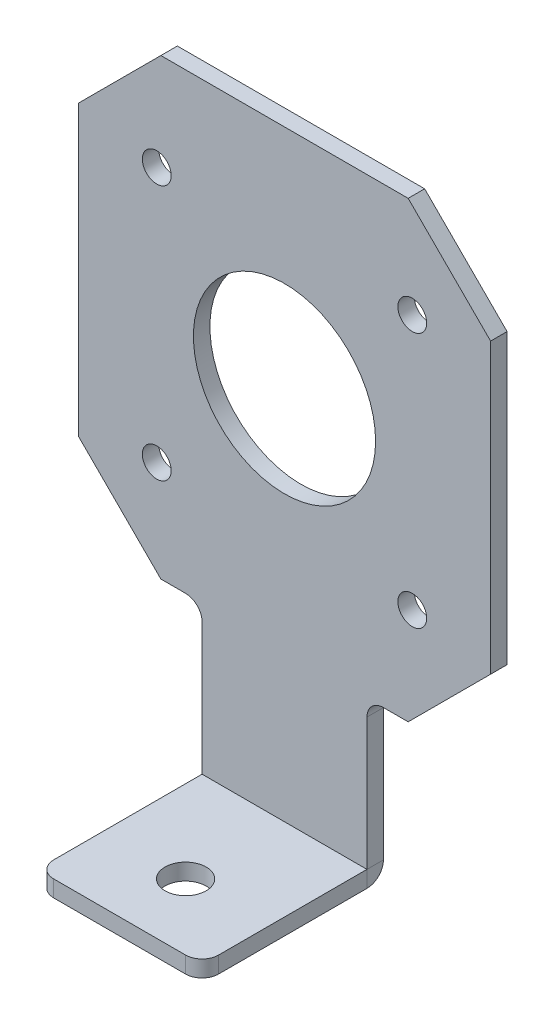
ISO-10303-21;
HEADER;
FILE_DESCRIPTION(('STEP AP214'),'2;1');
FILE_NAME('part.step','',(''),(''),'','','');
FILE_SCHEMA(('AUTOMOTIVE_DESIGN { 1 0 10303 214 1 1 1 1 }'));
ENDSEC;
DATA;
#1=APPLICATION_CONTEXT('core data for automotive mechanical design processes');
#2=APPLICATION_PROTOCOL_DEFINITION('international standard','automotive_design',2000,#1);
#3=PRODUCT_CONTEXT('',#1,'mechanical');
#4=PRODUCT('Part','Part','',(#3));
#5=PRODUCT_RELATED_PRODUCT_CATEGORY('part','',(#4));
#6=PRODUCT_DEFINITION_FORMATION('','',#4);
#7=PRODUCT_DEFINITION_CONTEXT('part definition',#1,'design');
#8=PRODUCT_DEFINITION('design','',#6,#7);
#9=PRODUCT_DEFINITION_SHAPE('','',#8);
#10=(LENGTH_UNIT() NAMED_UNIT(*) SI_UNIT(.MILLI.,.METRE.));
#11=(NAMED_UNIT(*) PLANE_ANGLE_UNIT() SI_UNIT($,.RADIAN.));
#12=(NAMED_UNIT(*) SI_UNIT($,.STERADIAN.) SOLID_ANGLE_UNIT());
#13=UNCERTAINTY_MEASURE_WITH_UNIT(LENGTH_MEASURE(1.E-05),#10,'distance_accuracy_value','');
#14=(GEOMETRIC_REPRESENTATION_CONTEXT(3) GLOBAL_UNCERTAINTY_ASSIGNED_CONTEXT((#13)) GLOBAL_UNIT_ASSIGNED_CONTEXT((#10,
#11,#12)) REPRESENTATION_CONTEXT('',''));
#15=CARTESIAN_POINT('',(0.,0.,0.));
#16=DIRECTION('',(0.,0.,1.));
#17=DIRECTION('',(1.,0.,0.));
#18=AXIS2_PLACEMENT_3D('',#15,#16,#17);
#19=CARTESIAN_POINT('',(10.,-49.5,2.));
#20=DIRECTION('',(-1.,0.,0.));
#21=DIRECTION('',(0.,1.,0.));
#22=AXIS2_PLACEMENT_3D('',#19,#20,#21);
#23=PLANE('',#22);
#24=DIRECTION('',(0.,0.,1.));
#25=VECTOR('',#24,1.);
#26=CARTESIAN_POINT('',(10.,-45.5,2.));
#27=LINE('',#26,#25);
#28=CARTESIAN_POINT('',(10.,-45.5,0.));
#29=VERTEX_POINT('',#28);
#30=CARTESIAN_POINT('',(10.,-45.5,2.));
#31=VERTEX_POINT('',#30);
#32=EDGE_CURVE('E180',#29,#31,#27,.T.);
#33=ORIENTED_EDGE('',*,*,#32,.F.);
#34=DIRECTION('',(0.,1.,0.));
#35=VECTOR('',#34,1.);
#36=CARTESIAN_POINT('',(10.,0.,0.));
#37=LINE('',#36,#35);
#38=CARTESIAN_POINT('',(10.,-29.5,0.));
#39=VERTEX_POINT('',#38);
#40=EDGE_CURVE('E370',#29,#39,#37,.T.);
#41=ORIENTED_EDGE('',*,*,#40,.T.);
#42=DIRECTION('',(0.,0.,1.));
#43=VECTOR('',#42,1.);
#44=CARTESIAN_POINT('',(10.,-29.5,2.));
#45=LINE('',#44,#43);
#46=CARTESIAN_POINT('',(10.,-29.5,2.));
#47=VERTEX_POINT('',#46);
#48=EDGE_CURVE('E182',#39,#47,#45,.T.);
#49=ORIENTED_EDGE('',*,*,#48,.T.);
#50=DIRECTION('',(0.,1.,0.));
#51=VECTOR('',#50,1.);
#52=CARTESIAN_POINT('',(10.,-49.5,2.));
#53=LINE('',#52,#51);
#54=EDGE_CURVE('E176',#31,#47,#53,.T.);
#55=ORIENTED_EDGE('',*,*,#54,.F.);
#56=EDGE_LOOP('',(#33,#41,#49,#55));
#57=FACE_BOUND('',#56,.T.);
#58=ADVANCED_FACE('F42',(#57),#23,.F.);
#59=CARTESIAN_POINT('',(12.,-29.5,2.));
#60=DIRECTION('',(0.,0.,-1.));
#61=DIRECTION('',(-1.,0.,0.));
#62=AXIS2_PLACEMENT_3D('',#59,#60,#61);
#63=CYLINDRICAL_SURFACE('',#62,2.);
#64=ORIENTED_EDGE('',*,*,#48,.F.);
#65=CARTESIAN_POINT('',(12.,-29.5,0.));
#66=DIRECTION('',(0.,0.,-1.));
#67=DIRECTION('',(-1.,0.,0.));
#68=AXIS2_PLACEMENT_3D('',#65,#66,#67);
#69=CIRCLE('',#68,2.);
#70=CARTESIAN_POINT('',(12.,-27.5,0.));
#71=VERTEX_POINT('',#70);
#72=EDGE_CURVE('E366',#39,#71,#69,.T.);
#73=ORIENTED_EDGE('',*,*,#72,.T.);
#74=DIRECTION('',(0.,0.,1.));
#75=VECTOR('',#74,1.);
#76=CARTESIAN_POINT('',(12.,-27.5,2.));
#77=LINE('',#76,#75);
#78=CARTESIAN_POINT('',(12.,-27.5,2.));
#79=VERTEX_POINT('',#78);
#80=EDGE_CURVE('E405',#71,#79,#77,.T.);
#81=ORIENTED_EDGE('',*,*,#80,.T.);
#82=CARTESIAN_POINT('',(12.,-29.5,2.));
#83=DIRECTION('',(0.,0.,-1.));
#84=DIRECTION('',(-1.,0.,0.));
#85=AXIS2_PLACEMENT_3D('',#82,#83,#84);
#86=CIRCLE('',#85,2.);
#87=EDGE_CURVE('E187',#47,#79,#86,.T.);
#88=ORIENTED_EDGE('',*,*,#87,.F.);
#89=EDGE_LOOP('',(#64,#73,#81,#88));
#90=FACE_BOUND('',#89,.T.);
#91=ADVANCED_FACE('F479',(#90),#63,.F.);
#92=CARTESIAN_POINT('',(10.,-27.5,2.));
#93=DIRECTION('',(0.,1.,0.));
#94=DIRECTION('',(1.,0.,0.));
#95=AXIS2_PLACEMENT_3D('',#92,#93,#94);
#96=PLANE('',#95);
#97=ORIENTED_EDGE('',*,*,#80,.F.);
#98=DIRECTION('',(-1.,0.,0.));
#99=VECTOR('',#98,1.);
#100=CARTESIAN_POINT('',(0.,-27.5,0.));
#101=LINE('',#100,#99);
#102=CARTESIAN_POINT('',(15.,-27.5,0.));
#103=VERTEX_POINT('',#102);
#104=EDGE_CURVE('E362',#71,#103,#101,.F.);
#105=ORIENTED_EDGE('',*,*,#104,.T.);
#106=DIRECTION('',(0.,0.,1.));
#107=VECTOR('',#106,1.);
#108=CARTESIAN_POINT('',(15.,-27.5,2.));
#109=LINE('',#108,#107);
#110=CARTESIAN_POINT('',(15.,-27.5,2.));
#111=VERTEX_POINT('',#110);
#112=EDGE_CURVE('E402',#103,#111,#109,.T.);
#113=ORIENTED_EDGE('',*,*,#112,.T.);
#114=DIRECTION('',(1.,0.,0.));
#115=VECTOR('',#114,1.);
#116=CARTESIAN_POINT('',(10.,-27.5,2.));
#117=LINE('',#116,#115);
#118=EDGE_CURVE('E263',#79,#111,#117,.T.);
#119=ORIENTED_EDGE('',*,*,#118,.F.);
#120=EDGE_LOOP('',(#97,#105,#113,#119));
#121=FACE_BOUND('',#120,.T.);
#122=ADVANCED_FACE('F484',(#121),#96,.F.);
#123=CARTESIAN_POINT('',(25.,-17.5,2.));
#124=DIRECTION('',(0.707106781186547,-0.707106781186549,0.));
#125=DIRECTION('',(-0.707106781186549,-0.707106781186547,0.));
#126=AXIS2_PLACEMENT_3D('',#123,#124,#125);
#127=PLANE('',#126);
#128=ORIENTED_EDGE('',*,*,#112,.F.);
#129=DIRECTION('',(-0.707106781186549,-0.707106781186547,0.));
#130=VECTOR('',#129,1.);
#131=CARTESIAN_POINT('',(25.,-17.5,0.));
#132=LINE('',#131,#130);
#133=CARTESIAN_POINT('',(25.,-17.5,0.));
#134=VERTEX_POINT('',#133);
#135=EDGE_CURVE('E358',#103,#134,#132,.F.);
#136=ORIENTED_EDGE('',*,*,#135,.T.);
#137=DIRECTION('',(0.,0.,1.));
#138=VECTOR('',#137,1.);
#139=CARTESIAN_POINT('',(25.,-17.5,2.));
#140=LINE('',#139,#138);
#141=CARTESIAN_POINT('',(25.,-17.5,2.));
#142=VERTEX_POINT('',#141);
#143=EDGE_CURVE('E399',#134,#142,#140,.T.);
#144=ORIENTED_EDGE('',*,*,#143,.T.);
#145=DIRECTION('',(-0.707106781186549,-0.707106781186547,0.));
#146=VECTOR('',#145,1.);
#147=CARTESIAN_POINT('',(25.,-17.5,2.));
#148=LINE('',#147,#146);
#149=EDGE_CURVE('E267',#111,#142,#148,.F.);
#150=ORIENTED_EDGE('',*,*,#149,.F.);
#151=EDGE_LOOP('',(#128,#136,#144,#150));
#152=FACE_BOUND('',#151,.T.);
#153=ADVANCED_FACE('F542',(#152),#127,.T.);
#154=CARTESIAN_POINT('',(25.,-27.5,2.));
#155=DIRECTION('',(-1.,0.,0.));
#156=DIRECTION('',(0.,1.,0.));
#157=AXIS2_PLACEMENT_3D('',#154,#155,#156);
#158=PLANE('',#157);
#159=ORIENTED_EDGE('',*,*,#143,.F.);
#160=DIRECTION('',(0.,1.,0.));
#161=VECTOR('',#160,1.);
#162=CARTESIAN_POINT('',(25.,0.,0.));
#163=LINE('',#162,#161);
#164=CARTESIAN_POINT('',(25.,17.5,0.));
#165=VERTEX_POINT('',#164);
#166=EDGE_CURVE('E354',#134,#165,#163,.T.);
#167=ORIENTED_EDGE('',*,*,#166,.T.);
#168=DIRECTION('',(0.,0.,1.));
#169=VECTOR('',#168,1.);
#170=CARTESIAN_POINT('',(25.,17.5,2.));
#171=LINE('',#170,#169);
#172=CARTESIAN_POINT('',(25.,17.5,2.));
#173=VERTEX_POINT('',#172);
#174=EDGE_CURVE('E396',#165,#173,#171,.T.);
#175=ORIENTED_EDGE('',*,*,#174,.T.);
#176=DIRECTION('',(0.,1.,0.));
#177=VECTOR('',#176,1.);
#178=CARTESIAN_POINT('',(25.,-27.5,2.));
#179=LINE('',#178,#177);
#180=EDGE_CURVE('E271',#142,#173,#179,.T.);
#181=ORIENTED_EDGE('',*,*,#180,.F.);
#182=EDGE_LOOP('',(#159,#167,#175,#181));
#183=FACE_BOUND('',#182,.T.);
#184=ADVANCED_FACE('F537',(#183),#158,.F.);
#185=CARTESIAN_POINT('',(15.,27.5,2.));
#186=DIRECTION('',(0.707106781186549,0.707106781186547,0.));
#187=DIRECTION('',(0.707106781186547,-0.707106781186549,0.));
#188=AXIS2_PLACEMENT_3D('',#185,#186,#187);
#189=PLANE('',#188);
#190=ORIENTED_EDGE('',*,*,#174,.F.);
#191=DIRECTION('',(0.707106781186547,-0.707106781186549,0.));
#192=VECTOR('',#191,1.);
#193=CARTESIAN_POINT('',(15.,27.5,0.));
#194=LINE('',#193,#192);
#195=CARTESIAN_POINT('',(15.,27.5,0.));
#196=VERTEX_POINT('',#195);
#197=EDGE_CURVE('E350',#165,#196,#194,.F.);
#198=ORIENTED_EDGE('',*,*,#197,.T.);
#199=DIRECTION('',(0.,0.,1.));
#200=VECTOR('',#199,1.);
#201=CARTESIAN_POINT('',(15.,27.5,2.));
#202=LINE('',#201,#200);
#203=CARTESIAN_POINT('',(15.,27.5,2.));
#204=VERTEX_POINT('',#203);
#205=EDGE_CURVE('E393',#196,#204,#202,.T.);
#206=ORIENTED_EDGE('',*,*,#205,.T.);
#207=DIRECTION('',(0.707106781186547,-0.707106781186549,0.));
#208=VECTOR('',#207,1.);
#209=CARTESIAN_POINT('',(15.,27.5,2.));
#210=LINE('',#209,#208);
#211=EDGE_CURVE('E275',#173,#204,#210,.F.);
#212=ORIENTED_EDGE('',*,*,#211,.F.);
#213=EDGE_LOOP('',(#190,#198,#206,#212));
#214=FACE_BOUND('',#213,.T.);
#215=ADVANCED_FACE('F533',(#214),#189,.T.);
#216=CARTESIAN_POINT('',(-25.,27.5,2.));
#217=DIRECTION('',(0.,-1.,0.));
#218=DIRECTION('',(-1.,0.,0.));
#219=AXIS2_PLACEMENT_3D('',#216,#217,#218);
#220=PLANE('',#219);
#221=ORIENTED_EDGE('',*,*,#205,.F.);
#222=DIRECTION('',(-1.,0.,0.));
#223=VECTOR('',#222,1.);
#224=CARTESIAN_POINT('',(0.,27.5,0.));
#225=LINE('',#224,#223);
#226=CARTESIAN_POINT('',(-15.,27.5,0.));
#227=VERTEX_POINT('',#226);
#228=EDGE_CURVE('E346',#196,#227,#225,.T.);
#229=ORIENTED_EDGE('',*,*,#228,.T.);
#230=DIRECTION('',(0.,0.,1.));
#231=VECTOR('',#230,1.);
#232=CARTESIAN_POINT('',(-15.,27.5,2.));
#233=LINE('',#232,#231);
#234=CARTESIAN_POINT('',(-15.,27.5,2.));
#235=VERTEX_POINT('',#234);
#236=EDGE_CURVE('E390',#227,#235,#233,.T.);
#237=ORIENTED_EDGE('',*,*,#236,.T.);
#238=DIRECTION('',(-1.,0.,0.));
#239=VECTOR('',#238,1.);
#240=CARTESIAN_POINT('',(-25.,27.5,2.));
#241=LINE('',#240,#239);
#242=EDGE_CURVE('E279',#204,#235,#241,.T.);
#243=ORIENTED_EDGE('',*,*,#242,.F.);
#244=EDGE_LOOP('',(#221,#229,#237,#243));
#245=FACE_BOUND('',#244,.T.);
#246=ADVANCED_FACE('F530',(#245),#220,.F.);
#247=CARTESIAN_POINT('',(-25.,17.5,2.));
#248=DIRECTION('',(-0.707106781186547,0.707106781186549,0.));
#249=DIRECTION('',(0.707106781186549,0.707106781186547,0.));
#250=AXIS2_PLACEMENT_3D('',#247,#248,#249);
#251=PLANE('',#250);
#252=ORIENTED_EDGE('',*,*,#236,.F.);
#253=DIRECTION('',(0.707106781186549,0.707106781186547,0.));
#254=VECTOR('',#253,1.);
#255=CARTESIAN_POINT('',(-25.,17.5,0.));
#256=LINE('',#255,#254);
#257=CARTESIAN_POINT('',(-25.,17.5,0.));
#258=VERTEX_POINT('',#257);
#259=EDGE_CURVE('E342',#227,#258,#256,.F.);
#260=ORIENTED_EDGE('',*,*,#259,.T.);
#261=DIRECTION('',(0.,0.,1.));
#262=VECTOR('',#261,1.);
#263=CARTESIAN_POINT('',(-25.,17.5,2.));
#264=LINE('',#263,#262);
#265=CARTESIAN_POINT('',(-25.,17.5,2.));
#266=VERTEX_POINT('',#265);
#267=EDGE_CURVE('E387',#258,#266,#264,.T.);
#268=ORIENTED_EDGE('',*,*,#267,.T.);
#269=DIRECTION('',(0.707106781186549,0.707106781186547,0.));
#270=VECTOR('',#269,1.);
#271=CARTESIAN_POINT('',(-25.,17.5,2.));
#272=LINE('',#271,#270);
#273=EDGE_CURVE('E283',#235,#266,#272,.F.);
#274=ORIENTED_EDGE('',*,*,#273,.F.);
#275=EDGE_LOOP('',(#252,#260,#268,#274));
#276=FACE_BOUND('',#275,.T.);
#277=ADVANCED_FACE('F525',(#276),#251,.T.);
#278=CARTESIAN_POINT('',(-25.,-27.5,2.));
#279=DIRECTION('',(1.,0.,0.));
#280=DIRECTION('',(0.,-1.,0.));
#281=AXIS2_PLACEMENT_3D('',#278,#279,#280);
#282=PLANE('',#281);
#283=ORIENTED_EDGE('',*,*,#267,.F.);
#284=DIRECTION('',(0.,1.,0.));
#285=VECTOR('',#284,1.);
#286=CARTESIAN_POINT('',(-25.,0.,0.));
#287=LINE('',#286,#285);
#288=CARTESIAN_POINT('',(-25.,-17.5,0.));
#289=VERTEX_POINT('',#288);
#290=EDGE_CURVE('E338',#258,#289,#287,.F.);
#291=ORIENTED_EDGE('',*,*,#290,.T.);
#292=DIRECTION('',(0.,0.,1.));
#293=VECTOR('',#292,1.);
#294=CARTESIAN_POINT('',(-25.,-17.5,2.));
#295=LINE('',#294,#293);
#296=CARTESIAN_POINT('',(-25.,-17.5,2.));
#297=VERTEX_POINT('',#296);
#298=EDGE_CURVE('E384',#289,#297,#295,.T.);
#299=ORIENTED_EDGE('',*,*,#298,.T.);
#300=DIRECTION('',(0.,-1.,0.));
#301=VECTOR('',#300,1.);
#302=CARTESIAN_POINT('',(-25.,-27.5,2.));
#303=LINE('',#302,#301);
#304=EDGE_CURVE('E287',#266,#297,#303,.T.);
#305=ORIENTED_EDGE('',*,*,#304,.F.);
#306=EDGE_LOOP('',(#283,#291,#299,#305));
#307=FACE_BOUND('',#306,.T.);
#308=ADVANCED_FACE('F520',(#307),#282,.F.);
#309=CARTESIAN_POINT('',(-15.,-27.5,2.));
#310=DIRECTION('',(-0.707106781186549,-0.707106781186547,0.));
#311=DIRECTION('',(-0.707106781186547,0.707106781186549,0.));
#312=AXIS2_PLACEMENT_3D('',#309,#310,#311);
#313=PLANE('',#312);
#314=ORIENTED_EDGE('',*,*,#298,.F.);
#315=DIRECTION('',(-0.707106781186547,0.707106781186549,0.));
#316=VECTOR('',#315,1.);
#317=CARTESIAN_POINT('',(-15.,-27.5,0.));
#318=LINE('',#317,#316);
#319=CARTESIAN_POINT('',(-15.,-27.5,0.));
#320=VERTEX_POINT('',#319);
#321=EDGE_CURVE('E334',#289,#320,#318,.F.);
#322=ORIENTED_EDGE('',*,*,#321,.T.);
#323=DIRECTION('',(0.,0.,1.));
#324=VECTOR('',#323,1.);
#325=CARTESIAN_POINT('',(-15.,-27.5,2.));
#326=LINE('',#325,#324);
#327=CARTESIAN_POINT('',(-15.,-27.5,2.));
#328=VERTEX_POINT('',#327);
#329=EDGE_CURVE('E381',#320,#328,#326,.T.);
#330=ORIENTED_EDGE('',*,*,#329,.T.);
#331=DIRECTION('',(-0.707106781186547,0.707106781186549,0.));
#332=VECTOR('',#331,1.);
#333=CARTESIAN_POINT('',(-15.,-27.5,2.));
#334=LINE('',#333,#332);
#335=EDGE_CURVE('E291',#297,#328,#334,.F.);
#336=ORIENTED_EDGE('',*,*,#335,.F.);
#337=EDGE_LOOP('',(#314,#322,#330,#336));
#338=FACE_BOUND('',#337,.T.);
#339=ADVANCED_FACE('F516',(#338),#313,.T.);
#340=CARTESIAN_POINT('',(-25.,-27.5,2.));
#341=DIRECTION('',(0.,1.,0.));
#342=DIRECTION('',(1.,0.,0.));
#343=AXIS2_PLACEMENT_3D('',#340,#341,#342);
#344=PLANE('',#343);
#345=ORIENTED_EDGE('',*,*,#329,.F.);
#346=DIRECTION('',(-1.,0.,0.));
#347=VECTOR('',#346,1.);
#348=CARTESIAN_POINT('',(0.,-27.5,0.));
#349=LINE('',#348,#347);
#350=CARTESIAN_POINT('',(-12.,-27.5,0.));
#351=VERTEX_POINT('',#350);
#352=EDGE_CURVE('E330',#320,#351,#349,.F.);
#353=ORIENTED_EDGE('',*,*,#352,.T.);
#354=DIRECTION('',(0.,0.,1.));
#355=VECTOR('',#354,1.);
#356=CARTESIAN_POINT('',(-12.,-27.5,2.));
#357=LINE('',#356,#355);
#358=CARTESIAN_POINT('',(-12.,-27.5,2.));
#359=VERTEX_POINT('',#358);
#360=EDGE_CURVE('E378',#351,#359,#357,.T.);
#361=ORIENTED_EDGE('',*,*,#360,.T.);
#362=DIRECTION('',(1.,0.,0.));
#363=VECTOR('',#362,1.);
#364=CARTESIAN_POINT('',(-25.,-27.5,2.));
#365=LINE('',#364,#363);
#366=EDGE_CURVE('E295',#328,#359,#365,.T.);
#367=ORIENTED_EDGE('',*,*,#366,.F.);
#368=EDGE_LOOP('',(#345,#353,#361,#367));
#369=FACE_BOUND('',#368,.T.);
#370=ADVANCED_FACE('F563',(#369),#344,.F.);
#371=CARTESIAN_POINT('',(-12.,-29.5,2.));
#372=DIRECTION('',(0.,0.,-1.));
#373=DIRECTION('',(-1.,0.,0.));
#374=AXIS2_PLACEMENT_3D('',#371,#372,#373);
#375=CYLINDRICAL_SURFACE('',#374,2.);
#376=ORIENTED_EDGE('',*,*,#360,.F.);
#377=CARTESIAN_POINT('',(-12.,-29.5,0.));
#378=DIRECTION('',(0.,0.,-1.));
#379=DIRECTION('',(-1.,0.,0.));
#380=AXIS2_PLACEMENT_3D('',#377,#378,#379);
#381=CIRCLE('',#380,2.);
#382=CARTESIAN_POINT('',(-10.,-29.5,0.));
#383=VERTEX_POINT('',#382);
#384=EDGE_CURVE('E243',#351,#383,#381,.T.);
#385=ORIENTED_EDGE('',*,*,#384,.T.);
#386=DIRECTION('',(0.,0.,1.));
#387=VECTOR('',#386,1.);
#388=CARTESIAN_POINT('',(-10.,-29.5,2.));
#389=LINE('',#388,#387);
#390=CARTESIAN_POINT('',(-10.,-29.5,2.));
#391=VERTEX_POINT('',#390);
#392=EDGE_CURVE('E375',#383,#391,#389,.T.);
#393=ORIENTED_EDGE('',*,*,#392,.T.);
#394=CARTESIAN_POINT('',(-12.,-29.5,2.));
#395=DIRECTION('',(0.,0.,-1.));
#396=DIRECTION('',(-1.,0.,0.));
#397=AXIS2_PLACEMENT_3D('',#394,#395,#396);
#398=CIRCLE('',#397,2.);
#399=EDGE_CURVE('E299',#359,#391,#398,.T.);
#400=ORIENTED_EDGE('',*,*,#399,.F.);
#401=EDGE_LOOP('',(#376,#385,#393,#400));
#402=FACE_BOUND('',#401,.T.);
#403=ADVANCED_FACE('F510',(#402),#375,.F.);
#404=CARTESIAN_POINT('',(-9.99999999999999,-49.5,2.));
#405=DIRECTION('',(1.,0.,0.));
#406=DIRECTION('',(0.,-1.,0.));
#407=AXIS2_PLACEMENT_3D('',#404,#405,#406);
#408=PLANE('',#407);
#409=ORIENTED_EDGE('',*,*,#392,.F.);
#410=DIRECTION('',(0.,1.,0.));
#411=VECTOR('',#410,1.);
#412=CARTESIAN_POINT('',(-10.,0.,0.));
#413=LINE('',#412,#411);
#414=CARTESIAN_POINT('',(-9.99999999999999,-45.5,0.));
#415=VERTEX_POINT('',#414);
#416=EDGE_CURVE('E322',#383,#415,#413,.F.);
#417=ORIENTED_EDGE('',*,*,#416,.T.);
#418=DIRECTION('',(0.,0.,1.));
#419=VECTOR('',#418,1.);
#420=CARTESIAN_POINT('',(-9.99999999999999,-45.5,2.));
#421=LINE('',#420,#419);
#422=CARTESIAN_POINT('',(-9.99999999999999,-45.5,2.));
#423=VERTEX_POINT('',#422);
#424=EDGE_CURVE('E302',#415,#423,#421,.T.);
#425=ORIENTED_EDGE('',*,*,#424,.T.);
#426=DIRECTION('',(0.,-1.,0.));
#427=VECTOR('',#426,1.);
#428=CARTESIAN_POINT('',(-9.99999999999999,-49.5,2.));
#429=LINE('',#428,#427);
#430=EDGE_CURVE('E195',#391,#423,#429,.T.);
#431=ORIENTED_EDGE('',*,*,#430,.F.);
#432=EDGE_LOOP('',(#409,#417,#425,#431));
#433=FACE_BOUND('',#432,.T.);
#434=ADVANCED_FACE('F507',(#433),#408,.F.);
#435=CARTESIAN_POINT('',(0.,0.,2.));
#436=DIRECTION('',(0.,0.,-1.));
#437=DIRECTION('',(-1.,0.,0.));
#438=AXIS2_PLACEMENT_3D('',#435,#436,#437);
#439=CYLINDRICAL_SURFACE('',#438,11.05);
#440=CARTESIAN_POINT('',(0.,0.,2.));
#441=DIRECTION('',(0.,0.,1.));
#442=DIRECTION('',(1.,0.,0.));
#443=AXIS2_PLACEMENT_3D('',#440,#441,#442);
#444=CIRCLE('',#443,11.05);
#445=CARTESIAN_POINT('',(11.05,0.,2.));
#446=VERTEX_POINT('',#445);
#447=EDGE_CURVE('E238',#446,#446,#444,.T.);
#448=ORIENTED_EDGE('',*,*,#447,.T.);
#449=EDGE_LOOP('',(#448));
#450=FACE_BOUND('',#449,.T.);
#451=CARTESIAN_POINT('',(0.,0.,0.));
#452=DIRECTION('',(0.,0.,1.));
#453=DIRECTION('',(1.,0.,0.));
#454=AXIS2_PLACEMENT_3D('',#451,#452,#453);
#455=CIRCLE('',#454,11.05);
#456=CARTESIAN_POINT('',(11.05,0.,0.));
#457=VERTEX_POINT('',#456);
#458=EDGE_CURVE('E237',#457,#457,#455,.T.);
#459=ORIENTED_EDGE('',*,*,#458,.F.);
#460=EDGE_LOOP('',(#459));
#461=FACE_BOUND('',#460,.T.);
#462=ADVANCED_FACE('F570',(#450,#461),#439,.F.);
#463=CARTESIAN_POINT('',(-15.5,-15.5,2.));
#464=DIRECTION('',(0.,0.,-1.));
#465=DIRECTION('',(-1.,0.,0.));
#466=AXIS2_PLACEMENT_3D('',#463,#464,#465);
#467=CYLINDRICAL_SURFACE('',#466,1.75);
#468=CARTESIAN_POINT('',(-15.5,-15.5,2.));
#469=DIRECTION('',(0.,0.,1.));
#470=DIRECTION('',(1.,0.,0.));
#471=AXIS2_PLACEMENT_3D('',#468,#469,#470);
#472=CIRCLE('',#471,1.75);
#473=CARTESIAN_POINT('',(-13.75,-15.5,2.));
#474=VERTEX_POINT('',#473);
#475=EDGE_CURVE('E242',#474,#474,#472,.T.);
#476=ORIENTED_EDGE('',*,*,#475,.T.);
#477=EDGE_LOOP('',(#476));
#478=FACE_BOUND('',#477,.T.);
#479=CARTESIAN_POINT('',(-15.5,-15.5,0.));
#480=DIRECTION('',(0.,0.,1.));
#481=DIRECTION('',(1.,0.,0.));
#482=AXIS2_PLACEMENT_3D('',#479,#480,#481);
#483=CIRCLE('',#482,1.75);
#484=CARTESIAN_POINT('',(-13.75,-15.5,0.));
#485=VERTEX_POINT('',#484);
#486=EDGE_CURVE('E306',#485,#485,#483,.T.);
#487=ORIENTED_EDGE('',*,*,#486,.F.);
#488=EDGE_LOOP('',(#487));
#489=FACE_BOUND('',#488,.T.);
#490=ADVANCED_FACE('F582',(#478,#489),#467,.F.);
#491=CARTESIAN_POINT('',(15.5,-15.5,2.));
#492=DIRECTION('',(0.,0.,-1.));
#493=DIRECTION('',(-1.,0.,0.));
#494=AXIS2_PLACEMENT_3D('',#491,#492,#493);
#495=CYLINDRICAL_SURFACE('',#494,1.74999999999999);
#496=CARTESIAN_POINT('',(15.5,-15.5,2.));
#497=DIRECTION('',(0.,0.,1.));
#498=DIRECTION('',(1.,0.,0.));
#499=AXIS2_PLACEMENT_3D('',#496,#497,#498);
#500=CIRCLE('',#499,1.74999999999999);
#501=CARTESIAN_POINT('',(17.25,-15.5,2.));
#502=VERTEX_POINT('',#501);
#503=EDGE_CURVE('E247',#502,#502,#500,.T.);
#504=ORIENTED_EDGE('',*,*,#503,.T.);
#505=EDGE_LOOP('',(#504));
#506=FACE_BOUND('',#505,.T.);
#507=CARTESIAN_POINT('',(15.5,-15.5,0.));
#508=DIRECTION('',(0.,0.,1.));
#509=DIRECTION('',(1.,0.,0.));
#510=AXIS2_PLACEMENT_3D('',#507,#508,#509);
#511=CIRCLE('',#510,1.74999999999999);
#512=CARTESIAN_POINT('',(17.25,-15.5,0.));
#513=VERTEX_POINT('',#512);
#514=EDGE_CURVE('E310',#513,#513,#511,.T.);
#515=ORIENTED_EDGE('',*,*,#514,.F.);
#516=EDGE_LOOP('',(#515));
#517=FACE_BOUND('',#516,.T.);
#518=ADVANCED_FACE('F578',(#506,#517),#495,.F.);
#519=CARTESIAN_POINT('',(-15.5,15.5,2.));
#520=DIRECTION('',(0.,0.,-1.));
#521=DIRECTION('',(-1.,0.,0.));
#522=AXIS2_PLACEMENT_3D('',#519,#520,#521);
#523=CYLINDRICAL_SURFACE('',#522,1.75);
#524=CARTESIAN_POINT('',(-15.5,15.5,2.));
#525=DIRECTION('',(0.,0.,1.));
#526=DIRECTION('',(1.,0.,0.));
#527=AXIS2_PLACEMENT_3D('',#524,#525,#526);
#528=CIRCLE('',#527,1.75);
#529=CARTESIAN_POINT('',(-13.75,15.5,2.));
#530=VERTEX_POINT('',#529);
#531=EDGE_CURVE('E251',#530,#530,#528,.T.);
#532=ORIENTED_EDGE('',*,*,#531,.T.);
#533=EDGE_LOOP('',(#532));
#534=FACE_BOUND('',#533,.T.);
#535=CARTESIAN_POINT('',(-15.5,15.5,0.));
#536=DIRECTION('',(0.,0.,1.));
#537=DIRECTION('',(1.,0.,0.));
#538=AXIS2_PLACEMENT_3D('',#535,#536,#537);
#539=CIRCLE('',#538,1.75);
#540=CARTESIAN_POINT('',(-13.75,15.5,0.));
#541=VERTEX_POINT('',#540);
#542=EDGE_CURVE('E314',#541,#541,#539,.T.);
#543=ORIENTED_EDGE('',*,*,#542,.F.);
#544=EDGE_LOOP('',(#543));
#545=FACE_BOUND('',#544,.T.);
#546=ADVANCED_FACE('F574',(#534,#545),#523,.F.);
#547=CARTESIAN_POINT('',(15.5,15.5,2.));
#548=DIRECTION('',(0.,0.,-1.));
#549=DIRECTION('',(-1.,0.,0.));
#550=AXIS2_PLACEMENT_3D('',#547,#548,#549);
#551=CYLINDRICAL_SURFACE('',#550,1.75);
#552=CARTESIAN_POINT('',(15.5,15.5,2.));
#553=DIRECTION('',(0.,0.,1.));
#554=DIRECTION('',(1.,0.,0.));
#555=AXIS2_PLACEMENT_3D('',#552,#553,#554);
#556=CIRCLE('',#555,1.75);
#557=CARTESIAN_POINT('',(17.25,15.5,2.));
#558=VERTEX_POINT('',#557);
#559=EDGE_CURVE('E255',#558,#558,#556,.T.);
#560=ORIENTED_EDGE('',*,*,#559,.T.);
#561=EDGE_LOOP('',(#560));
#562=FACE_BOUND('',#561,.T.);
#563=CARTESIAN_POINT('',(15.5,15.5,0.));
#564=DIRECTION('',(0.,0.,1.));
#565=DIRECTION('',(1.,0.,0.));
#566=AXIS2_PLACEMENT_3D('',#563,#564,#565);
#567=CIRCLE('',#566,1.75);
#568=CARTESIAN_POINT('',(17.25,15.5,0.));
#569=VERTEX_POINT('',#568);
#570=EDGE_CURVE('E318',#569,#569,#567,.T.);
#571=ORIENTED_EDGE('',*,*,#570,.F.);
#572=EDGE_LOOP('',(#571));
#573=FACE_BOUND('',#572,.T.);
#574=ADVANCED_FACE('F571',(#562,#573),#551,.F.);
#575=CARTESIAN_POINT('',(0.,0.,2.));
#576=DIRECTION('',(0.,0.,-1.));
#577=DIRECTION('',(-1.,0.,0.));
#578=AXIS2_PLACEMENT_3D('',#575,#576,#577);
#579=PLANE('',#578);
#580=ORIENTED_EDGE('',*,*,#447,.F.);
#581=EDGE_LOOP('',(#580));
#582=FACE_BOUND('',#581,.T.);
#583=ORIENTED_EDGE('',*,*,#475,.F.);
#584=EDGE_LOOP('',(#583));
#585=FACE_BOUND('',#584,.T.);
#586=ORIENTED_EDGE('',*,*,#503,.F.);
#587=EDGE_LOOP('',(#586));
#588=FACE_BOUND('',#587,.T.);
#589=ORIENTED_EDGE('',*,*,#531,.F.);
#590=EDGE_LOOP('',(#589));
#591=FACE_BOUND('',#590,.T.);
#592=ORIENTED_EDGE('',*,*,#559,.F.);
#593=EDGE_LOOP('',(#592));
#594=FACE_BOUND('',#593,.T.);
#595=ORIENTED_EDGE('',*,*,#430,.T.);
#596=DIRECTION('',(-1.,0.,0.));
#597=VECTOR('',#596,1.);
#598=CARTESIAN_POINT('',(10.,-45.5,2.));
#599=LINE('',#598,#597);
#600=EDGE_CURVE('E188',#423,#31,#599,.F.);
#601=ORIENTED_EDGE('',*,*,#600,.T.);
#602=ORIENTED_EDGE('',*,*,#54,.T.);
#603=ORIENTED_EDGE('',*,*,#87,.T.);
#604=ORIENTED_EDGE('',*,*,#118,.T.);
#605=ORIENTED_EDGE('',*,*,#149,.T.);
#606=ORIENTED_EDGE('',*,*,#180,.T.);
#607=ORIENTED_EDGE('',*,*,#211,.T.);
#608=ORIENTED_EDGE('',*,*,#242,.T.);
#609=ORIENTED_EDGE('',*,*,#273,.T.);
#610=ORIENTED_EDGE('',*,*,#304,.T.);
#611=ORIENTED_EDGE('',*,*,#335,.T.);
#612=ORIENTED_EDGE('',*,*,#366,.T.);
#613=ORIENTED_EDGE('',*,*,#399,.T.);
#614=EDGE_LOOP('',(#595,#601,#602,#603,#604,#605,#606,#607,#608,#609,#610,#611,#612,#613));
#615=FACE_BOUND('',#614,.T.);
#616=ADVANCED_FACE('F192',(#582,#585,#588,#591,#594,#615),#579,.F.);
#617=CARTESIAN_POINT('',(0.,0.,0.));
#618=DIRECTION('',(0.,0.,-1.));
#619=DIRECTION('',(-1.,0.,0.));
#620=AXIS2_PLACEMENT_3D('',#617,#618,#619);
#621=PLANE('',#620);
#622=ORIENTED_EDGE('',*,*,#458,.T.);
#623=EDGE_LOOP('',(#622));
#624=FACE_BOUND('',#623,.T.);
#625=ORIENTED_EDGE('',*,*,#486,.T.);
#626=EDGE_LOOP('',(#625));
#627=FACE_BOUND('',#626,.T.);
#628=ORIENTED_EDGE('',*,*,#514,.T.);
#629=EDGE_LOOP('',(#628));
#630=FACE_BOUND('',#629,.T.);
#631=ORIENTED_EDGE('',*,*,#542,.T.);
#632=EDGE_LOOP('',(#631));
#633=FACE_BOUND('',#632,.T.);
#634=ORIENTED_EDGE('',*,*,#570,.T.);
#635=EDGE_LOOP('',(#634));
#636=FACE_BOUND('',#635,.T.);
#637=ORIENTED_EDGE('',*,*,#416,.F.);
#638=ORIENTED_EDGE('',*,*,#384,.F.);
#639=ORIENTED_EDGE('',*,*,#352,.F.);
#640=ORIENTED_EDGE('',*,*,#321,.F.);
#641=ORIENTED_EDGE('',*,*,#290,.F.);
#642=ORIENTED_EDGE('',*,*,#259,.F.);
#643=ORIENTED_EDGE('',*,*,#228,.F.);
#644=ORIENTED_EDGE('',*,*,#197,.F.);
#645=ORIENTED_EDGE('',*,*,#166,.F.);
#646=ORIENTED_EDGE('',*,*,#135,.F.);
#647=ORIENTED_EDGE('',*,*,#104,.F.);
#648=ORIENTED_EDGE('',*,*,#72,.F.);
#649=ORIENTED_EDGE('',*,*,#40,.F.);
#650=DIRECTION('',(-1.,0.,0.));
#651=VECTOR('',#650,1.);
#652=CARTESIAN_POINT('',(0.,-45.5,0.));
#653=LINE('',#652,#651);
#654=EDGE_CURVE('E326',#415,#29,#653,.F.);
#655=ORIENTED_EDGE('',*,*,#654,.F.);
#656=EDGE_LOOP('',(#637,#638,#639,#640,#641,#642,#643,#644,#645,#646,#647,#648,#649,#655));
#657=FACE_BOUND('',#656,.T.);
#658=ADVANCED_FACE('F503',(#624,#627,#630,#633,#636,#657),#621,.T.);
#659=CARTESIAN_POINT('',(10.,-45.5,0.));
#660=DIRECTION('',(1.,0.,0.));
#661=DIRECTION('',(0.,0.,-1.));
#662=AXIS2_PLACEMENT_3D('',#659,#660,#661);
#663=PLANE('',#662);
#664=CARTESIAN_POINT('',(10.,-45.5,2.));
#665=DIRECTION('',(-1.,0.,0.));
#666=DIRECTION('',(0.,0.,1.));
#667=AXIS2_PLACEMENT_3D('',#664,#665,#666);
#668=CIRCLE('',#667,2.);
#669=CARTESIAN_POINT('',(10.,-47.5,1.99999999999999));
#670=VERTEX_POINT('',#669);
#671=EDGE_CURVE('E206',#29,#670,#668,.T.);
#672=ORIENTED_EDGE('',*,*,#671,.F.);
#673=ORIENTED_EDGE('',*,*,#32,.T.);
#674=DIRECTION('',(0.,1.,0.));
#675=VECTOR('',#674,1.);
#676=CARTESIAN_POINT('',(10.,-47.5,1.99999999999999));
#677=LINE('',#676,#675);
#678=EDGE_CURVE('E205',#670,#31,#677,.T.);
#679=ORIENTED_EDGE('',*,*,#678,.F.);
#680=EDGE_LOOP('',(#672,#673,#679));
#681=FACE_BOUND('',#680,.T.);
#682=ADVANCED_FACE('F203',(#681),#663,.T.);
#683=CARTESIAN_POINT('',(-9.99999999999999,-45.5,2.));
#684=DIRECTION('',(-1.,0.,0.));
#685=DIRECTION('',(0.,0.,1.));
#686=AXIS2_PLACEMENT_3D('',#683,#684,#685);
#687=CYLINDRICAL_SURFACE('',#686,2.);
#688=CARTESIAN_POINT('',(-9.99999999999999,-45.5,2.));
#689=DIRECTION('',(-1.,0.,0.));
#690=DIRECTION('',(0.,0.,1.));
#691=AXIS2_PLACEMENT_3D('',#688,#689,#690);
#692=CIRCLE('',#691,2.);
#693=CARTESIAN_POINT('',(-9.99999999999999,-47.5,1.99999999999999));
#694=VERTEX_POINT('',#693);
#695=EDGE_CURVE('E223',#415,#694,#692,.T.);
#696=ORIENTED_EDGE('',*,*,#695,.F.);
#697=ORIENTED_EDGE('',*,*,#654,.T.);
#698=ORIENTED_EDGE('',*,*,#671,.T.);
#699=DIRECTION('',(1.,0.,0.));
#700=VECTOR('',#699,1.);
#701=CARTESIAN_POINT('',(-9.99999999999999,-47.5,1.99999999999999));
#702=LINE('',#701,#700);
#703=EDGE_CURVE('E449',#694,#670,#702,.T.);
#704=ORIENTED_EDGE('',*,*,#703,.F.);
#705=EDGE_LOOP('',(#696,#697,#698,#704));
#706=FACE_BOUND('',#705,.T.);
#707=ADVANCED_FACE('F498',(#706),#687,.T.);
#708=CARTESIAN_POINT('',(-9.99999999999999,-45.5,0.));
#709=DIRECTION('',(1.,0.,0.));
#710=DIRECTION('',(0.,0.,-1.));
#711=AXIS2_PLACEMENT_3D('',#708,#709,#710);
#712=PLANE('',#711);
#713=ORIENTED_EDGE('',*,*,#424,.F.);
#714=ORIENTED_EDGE('',*,*,#695,.T.);
#715=DIRECTION('',(0.,1.,0.));
#716=VECTOR('',#715,1.);
#717=CARTESIAN_POINT('',(-9.99999999999999,-47.5,1.99999999999999));
#718=LINE('',#717,#716);
#719=EDGE_CURVE('E224',#694,#423,#718,.T.);
#720=ORIENTED_EDGE('',*,*,#719,.T.);
#721=EDGE_LOOP('',(#713,#714,#720));
#722=FACE_BOUND('',#721,.T.);
#723=ADVANCED_FACE('F600',(#722),#712,.F.);
#724=CARTESIAN_POINT('',(10.,-47.5000000000001,22.));
#725=DIRECTION('',(-1.,0.,0.));
#726=DIRECTION('',(0.,0.,1.));
#727=AXIS2_PLACEMENT_3D('',#724,#725,#726);
#728=PLANE('',#727);
#729=DIRECTION('',(0.,0.,1.));
#730=VECTOR('',#729,1.);
#731=CARTESIAN_POINT('',(10.,-45.5000000000001,22.));
#732=LINE('',#731,#730);
#733=CARTESIAN_POINT('',(10.,-45.5000000000001,20.));
#734=VERTEX_POINT('',#733);
#735=EDGE_CURVE('E211',#31,#734,#732,.T.);
#736=ORIENTED_EDGE('',*,*,#735,.T.);
#737=DIRECTION('',(0.,1.,0.));
#738=VECTOR('',#737,1.);
#739=CARTESIAN_POINT('',(10.,-47.5000000000001,20.));
#740=LINE('',#739,#738);
#741=CARTESIAN_POINT('',(10.,-47.5000000000001,20.));
#742=VERTEX_POINT('',#741);
#743=EDGE_CURVE('E11',#734,#742,#740,.F.);
#744=ORIENTED_EDGE('',*,*,#743,.T.);
#745=DIRECTION('',(0.,0.,1.));
#746=VECTOR('',#745,1.);
#747=CARTESIAN_POINT('',(10.,-47.5000000000001,22.));
#748=LINE('',#747,#746);
#749=EDGE_CURVE('E220',#670,#742,#748,.T.);
#750=ORIENTED_EDGE('',*,*,#749,.F.);
#751=ORIENTED_EDGE('',*,*,#678,.T.);
#752=EDGE_LOOP('',(#736,#744,#750,#751));
#753=FACE_BOUND('',#752,.T.);
#754=ADVANCED_FACE('F219',(#753),#728,.F.);
#755=CARTESIAN_POINT('',(-9.99999999999999,-47.5000000000001,22.));
#756=DIRECTION('',(0.,0.,-1.));
#757=DIRECTION('',(0.,1.,0.));
#758=AXIS2_PLACEMENT_3D('',#755,#756,#757);
#759=PLANE('',#758);
#760=DIRECTION('',(-1.,0.,0.));
#761=VECTOR('',#760,1.);
#762=CARTESIAN_POINT('',(-9.99999999999999,-45.5000000000001,22.));
#763=LINE('',#762,#761);
#764=CARTESIAN_POINT('',(8.00000000000001,-45.5000000000001,22.));
#765=VERTEX_POINT('',#764);
#766=CARTESIAN_POINT('',(-7.99999999999999,-45.5000000000001,22.));
#767=VERTEX_POINT('',#766);
#768=EDGE_CURVE('E216',#765,#767,#763,.T.);
#769=ORIENTED_EDGE('',*,*,#768,.T.);
#770=DIRECTION('',(0.,1.,0.));
#771=VECTOR('',#770,1.);
#772=CARTESIAN_POINT('',(-7.99999999999999,-47.5000000000001,22.));
#773=LINE('',#772,#771);
#774=CARTESIAN_POINT('',(-7.99999999999999,-47.5000000000001,22.));
#775=VERTEX_POINT('',#774);
#776=EDGE_CURVE('E64',#767,#775,#773,.F.);
#777=ORIENTED_EDGE('',*,*,#776,.T.);
#778=DIRECTION('',(-1.,0.,0.));
#779=VECTOR('',#778,1.);
#780=CARTESIAN_POINT('',(-9.99999999999999,-47.5000000000001,22.));
#781=LINE('',#780,#779);
#782=CARTESIAN_POINT('',(8.00000000000001,-47.5000000000001,22.));
#783=VERTEX_POINT('',#782);
#784=EDGE_CURVE('E434',#783,#775,#781,.T.);
#785=ORIENTED_EDGE('',*,*,#784,.F.);
#786=DIRECTION('',(0.,1.,0.));
#787=VECTOR('',#786,1.);
#788=CARTESIAN_POINT('',(8.00000000000001,-47.5000000000001,22.));
#789=LINE('',#788,#787);
#790=EDGE_CURVE('E421',#783,#765,#789,.T.);
#791=ORIENTED_EDGE('',*,*,#790,.T.);
#792=EDGE_LOOP('',(#769,#777,#785,#791));
#793=FACE_BOUND('',#792,.T.);
#794=ADVANCED_FACE('F444',(#793),#759,.F.);
#795=CARTESIAN_POINT('',(-9.99999999999999,-47.5,1.99999999999999));
#796=DIRECTION('',(1.,0.,0.));
#797=DIRECTION('',(0.,0.,-1.));
#798=AXIS2_PLACEMENT_3D('',#795,#796,#797);
#799=PLANE('',#798);
#800=DIRECTION('',(0.,0.,-1.));
#801=VECTOR('',#800,1.);
#802=CARTESIAN_POINT('',(-9.99999999999999,-47.5,1.99999999999999));
#803=LINE('',#802,#801);
#804=CARTESIAN_POINT('',(-9.99999999999999,-47.5000000000001,20.));
#805=VERTEX_POINT('',#804);
#806=EDGE_CURVE('E231',#805,#694,#803,.T.);
#807=ORIENTED_EDGE('',*,*,#806,.F.);
#808=DIRECTION('',(0.,1.,0.));
#809=VECTOR('',#808,1.);
#810=CARTESIAN_POINT('',(-9.99999999999999,-47.5000000000001,20.));
#811=LINE('',#810,#809);
#812=CARTESIAN_POINT('',(-9.99999999999999,-45.5000000000001,20.));
#813=VERTEX_POINT('',#812);
#814=EDGE_CURVE('E209',#805,#813,#811,.T.);
#815=ORIENTED_EDGE('',*,*,#814,.T.);
#816=DIRECTION('',(0.,0.,-1.));
#817=VECTOR('',#816,1.);
#818=CARTESIAN_POINT('',(-9.99999999999999,-45.5,2.));
#819=LINE('',#818,#817);
#820=EDGE_CURVE('E443',#813,#423,#819,.T.);
#821=ORIENTED_EDGE('',*,*,#820,.T.);
#822=ORIENTED_EDGE('',*,*,#719,.F.);
#823=EDGE_LOOP('',(#807,#815,#821,#822));
#824=FACE_BOUND('',#823,.T.);
#825=ADVANCED_FACE('F439',(#824),#799,.F.);
#826=CARTESIAN_POINT('',(0.,-47.5,-1.64842798991576E-13));
#827=DIRECTION('',(0.,1.,0.));
#828=DIRECTION('',(0.,0.,1.));
#829=AXIS2_PLACEMENT_3D('',#826,#827,#828);
#830=PLANE('',#829);
#831=CARTESIAN_POINT('',(0.,-47.5,13.9999999999997));
#832=DIRECTION('',(0.,1.,0.));
#833=DIRECTION('',(0.,0.,1.));
#834=AXIS2_PLACEMENT_3D('',#831,#832,#833);
#835=CIRCLE('',#834,2.5);
#836=CARTESIAN_POINT('',(0.,-47.5,16.4999999999997));
#837=VERTEX_POINT('',#836);
#838=EDGE_CURVE('E217',#837,#837,#835,.T.);
#839=ORIENTED_EDGE('',*,*,#838,.T.);
#840=EDGE_LOOP('',(#839));
#841=FACE_BOUND('',#840,.T.);
#842=ORIENTED_EDGE('',*,*,#784,.T.);
#843=CARTESIAN_POINT('',(-7.99999999999999,-47.5000000000001,20.));
#844=DIRECTION('',(0.,1.,0.));
#845=DIRECTION('',(0.,0.,1.));
#846=AXIS2_PLACEMENT_3D('',#843,#844,#845);
#847=CIRCLE('',#846,2.);
#848=EDGE_CURVE('E51',#775,#805,#847,.F.);
#849=ORIENTED_EDGE('',*,*,#848,.T.);
#850=ORIENTED_EDGE('',*,*,#806,.T.);
#851=ORIENTED_EDGE('',*,*,#703,.T.);
#852=ORIENTED_EDGE('',*,*,#749,.T.);
#853=CARTESIAN_POINT('',(8.00000000000001,-47.5000000000001,20.));
#854=DIRECTION('',(0.,1.,0.));
#855=DIRECTION('',(0.,0.,1.));
#856=AXIS2_PLACEMENT_3D('',#853,#854,#855);
#857=CIRCLE('',#856,2.);
#858=EDGE_CURVE('E427',#742,#783,#857,.F.);
#859=ORIENTED_EDGE('',*,*,#858,.T.);
#860=EDGE_LOOP('',(#842,#849,#850,#851,#852,#859));
#861=FACE_BOUND('',#860,.T.);
#862=ADVANCED_FACE('F433',(#841,#861),#830,.F.);
#863=CARTESIAN_POINT('',(0.,-45.5,-1.57859836313889E-13));
#864=DIRECTION('',(0.,1.,0.));
#865=DIRECTION('',(0.,0.,1.));
#866=AXIS2_PLACEMENT_3D('',#863,#864,#865);
#867=PLANE('',#866);
#868=CARTESIAN_POINT('',(0.,-45.5,13.9999999999997));
#869=DIRECTION('',(0.,1.,0.));
#870=DIRECTION('',(0.,0.,1.));
#871=AXIS2_PLACEMENT_3D('',#868,#869,#870);
#872=CIRCLE('',#871,2.5);
#873=CARTESIAN_POINT('',(0.,-45.5,16.4999999999997));
#874=VERTEX_POINT('',#873);
#875=EDGE_CURVE('E460',#874,#874,#872,.T.);
#876=ORIENTED_EDGE('',*,*,#875,.F.);
#877=EDGE_LOOP('',(#876));
#878=FACE_BOUND('',#877,.T.);
#879=ORIENTED_EDGE('',*,*,#820,.F.);
#880=CARTESIAN_POINT('',(-7.99999999999999,-45.5000000000001,20.));
#881=DIRECTION('',(0.,1.,0.));
#882=DIRECTION('',(0.,0.,1.));
#883=AXIS2_PLACEMENT_3D('',#880,#881,#882);
#884=CIRCLE('',#883,2.);
#885=EDGE_CURVE('E418',#813,#767,#884,.T.);
#886=ORIENTED_EDGE('',*,*,#885,.T.);
#887=ORIENTED_EDGE('',*,*,#768,.F.);
#888=CARTESIAN_POINT('',(8.00000000000001,-45.5000000000001,20.));
#889=DIRECTION('',(0.,1.,0.));
#890=DIRECTION('',(0.,0.,1.));
#891=AXIS2_PLACEMENT_3D('',#888,#889,#890);
#892=CIRCLE('',#891,2.);
#893=EDGE_CURVE('E214',#765,#734,#892,.T.);
#894=ORIENTED_EDGE('',*,*,#893,.T.);
#895=ORIENTED_EDGE('',*,*,#735,.F.);
#896=ORIENTED_EDGE('',*,*,#600,.F.);
#897=EDGE_LOOP('',(#879,#886,#887,#894,#895,#896));
#898=FACE_BOUND('',#897,.T.);
#899=ADVANCED_FACE('F212',(#878,#898),#867,.T.);
#900=CARTESIAN_POINT('',(0.,-55.5,13.9999999999997));
#901=DIRECTION('',(0.,1.,0.));
#902=DIRECTION('',(0.,0.,1.));
#903=AXIS2_PLACEMENT_3D('',#900,#901,#902);
#904=CYLINDRICAL_SURFACE('',#903,2.5);
#905=ORIENTED_EDGE('',*,*,#875,.T.);
#906=EDGE_LOOP('',(#905));
#907=FACE_BOUND('',#906,.T.);
#908=ORIENTED_EDGE('',*,*,#838,.F.);
#909=EDGE_LOOP('',(#908));
#910=FACE_BOUND('',#909,.T.);
#911=ADVANCED_FACE('F465',(#907,#910),#904,.F.);
#912=CARTESIAN_POINT('',(-7.99999999999999,-47.5000000000001,20.));
#913=DIRECTION('',(0.,1.,0.));
#914=DIRECTION('',(0.,0.,1.));
#915=AXIS2_PLACEMENT_3D('',#912,#913,#914);
#916=CYLINDRICAL_SURFACE('',#915,2.);
#917=ORIENTED_EDGE('',*,*,#848,.F.);
#918=ORIENTED_EDGE('',*,*,#776,.F.);
#919=ORIENTED_EDGE('',*,*,#885,.F.);
#920=ORIENTED_EDGE('',*,*,#814,.F.);
#921=EDGE_LOOP('',(#917,#918,#919,#920));
#922=FACE_BOUND('',#921,.T.);
#923=ADVANCED_FACE('F442',(#922),#916,.T.);
#924=CARTESIAN_POINT('',(8.00000000000001,-47.5000000000001,20.));
#925=DIRECTION('',(0.,1.,0.));
#926=DIRECTION('',(0.,0.,1.));
#927=AXIS2_PLACEMENT_3D('',#924,#925,#926);
#928=CYLINDRICAL_SURFACE('',#927,2.);
#929=ORIENTED_EDGE('',*,*,#858,.F.);
#930=ORIENTED_EDGE('',*,*,#743,.F.);
#931=ORIENTED_EDGE('',*,*,#893,.F.);
#932=ORIENTED_EDGE('',*,*,#790,.F.);
#933=EDGE_LOOP('',(#929,#930,#931,#932));
#934=FACE_BOUND('',#933,.T.);
#935=ADVANCED_FACE('F44',(#934),#928,.T.);
#936=CLOSED_SHELL('',(#58,#91,#122,#153,#184,#215,#246,#277,#308,#339,#370,#403,#434,#462,#490,
#518,#546,#574,#616,#658,#682,#707,#723,#754,#794,#825,#862,#899,#911,#923,#935));
#937=MANIFOLD_SOLID_BREP('B2',#936);
#938=ADVANCED_BREP_SHAPE_REPRESENTATION('',(#18,#937),#14);
#939=SHAPE_DEFINITION_REPRESENTATION(#9,#938);
ENDSEC;
END-ISO-10303-21;
